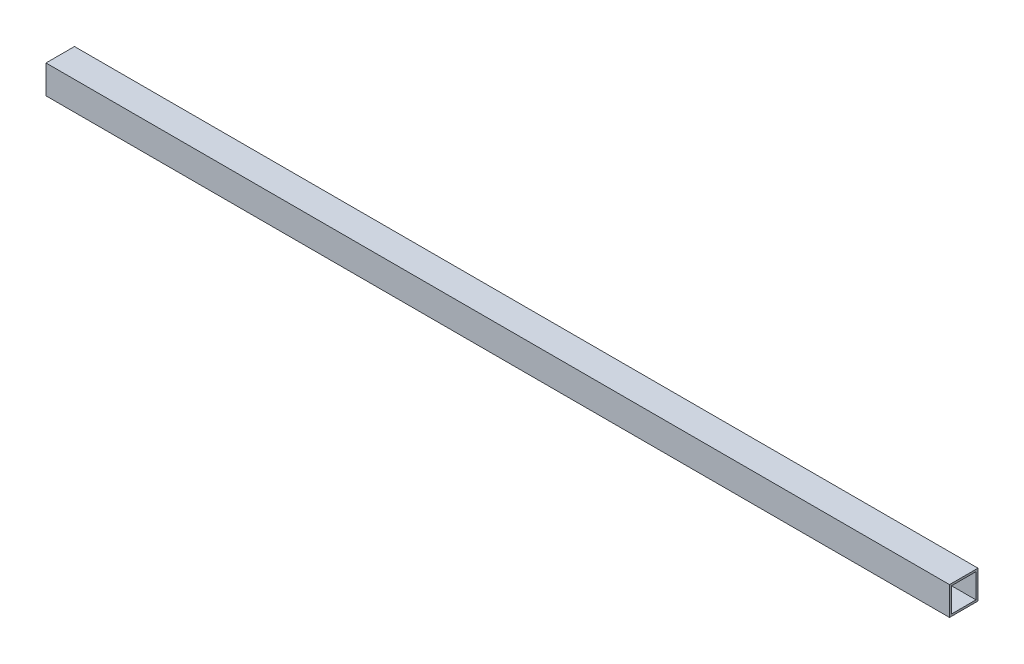
ISO-10303-21;
HEADER;
FILE_DESCRIPTION(('STEP AP214'),'2;1');
FILE_NAME('part.step','',(''),(''),'','','');
FILE_SCHEMA(('AUTOMOTIVE_DESIGN { 1 0 10303 214 1 1 1 1 }'));
ENDSEC;
DATA;
#1=APPLICATION_CONTEXT('core data for automotive mechanical design processes');
#2=APPLICATION_PROTOCOL_DEFINITION('international standard','automotive_design',2000,#1);
#3=PRODUCT_CONTEXT('',#1,'mechanical');
#4=PRODUCT('Part','Part','',(#3));
#5=PRODUCT_RELATED_PRODUCT_CATEGORY('part','',(#4));
#6=PRODUCT_DEFINITION_FORMATION('','',#4);
#7=PRODUCT_DEFINITION_CONTEXT('part definition',#1,'design');
#8=PRODUCT_DEFINITION('design','',#6,#7);
#9=PRODUCT_DEFINITION_SHAPE('','',#8);
#10=(LENGTH_UNIT() NAMED_UNIT(*) SI_UNIT(.MILLI.,.METRE.));
#11=(NAMED_UNIT(*) PLANE_ANGLE_UNIT() SI_UNIT($,.RADIAN.));
#12=(NAMED_UNIT(*) SI_UNIT($,.STERADIAN.) SOLID_ANGLE_UNIT());
#13=UNCERTAINTY_MEASURE_WITH_UNIT(LENGTH_MEASURE(1.E-05),#10,'distance_accuracy_value','');
#14=(GEOMETRIC_REPRESENTATION_CONTEXT(3) GLOBAL_UNCERTAINTY_ASSIGNED_CONTEXT((#13)) GLOBAL_UNIT_ASSIGNED_CONTEXT((#10,
#11,#12)) REPRESENTATION_CONTEXT('',''));
#15=CARTESIAN_POINT('',(0.,0.,0.));
#16=DIRECTION('',(0.,0.,1.));
#17=DIRECTION('',(1.,0.,0.));
#18=AXIS2_PLACEMENT_3D('',#15,#16,#17);
#19=CARTESIAN_POINT('',(0.,-41.275,44.45));
#20=DIRECTION('',(0.,-1.,0.));
#21=DIRECTION('',(0.,0.,-1.));
#22=AXIS2_PLACEMENT_3D('',#19,#20,#21);
#23=PLANE('',#22);
#24=DIRECTION('',(0.,0.,-1.));
#25=VECTOR('',#24,1.);
#26=CARTESIAN_POINT('',(-704.85,-41.275,44.45));
#27=LINE('',#26,#25);
#28=CARTESIAN_POINT('',(-704.85,-41.275,3.175));
#29=VERTEX_POINT('',#28);
#30=CARTESIAN_POINT('',(-704.85,-41.275,41.275));
#31=VERTEX_POINT('',#30);
#32=EDGE_CURVE('E114',#29,#31,#27,.F.);
#33=ORIENTED_EDGE('',*,*,#32,.T.);
#34=DIRECTION('',(1.,0.,0.));
#35=VECTOR('',#34,1.);
#36=CARTESIAN_POINT('',(0.,-41.275,41.275));
#37=LINE('',#36,#35);
#38=CARTESIAN_POINT('',(704.85,-41.275,41.275));
#39=VERTEX_POINT('',#38);
#40=EDGE_CURVE('E17',#31,#39,#37,.T.);
#41=ORIENTED_EDGE('',*,*,#40,.T.);
#42=DIRECTION('',(0.,0.,-1.));
#43=VECTOR('',#42,1.);
#44=CARTESIAN_POINT('',(704.85,-41.275,44.45));
#45=LINE('',#44,#43);
#46=CARTESIAN_POINT('',(704.85,-41.275,3.175));
#47=VERTEX_POINT('',#46);
#48=EDGE_CURVE('E105',#47,#39,#45,.F.);
#49=ORIENTED_EDGE('',*,*,#48,.F.);
#50=DIRECTION('',(1.,0.,0.));
#51=VECTOR('',#50,1.);
#52=CARTESIAN_POINT('',(0.,-41.275,3.175));
#53=LINE('',#52,#51);
#54=EDGE_CURVE('E101',#29,#47,#53,.T.);
#55=ORIENTED_EDGE('',*,*,#54,.F.);
#56=EDGE_LOOP('',(#33,#41,#49,#55));
#57=FACE_BOUND('',#56,.T.);
#58=ADVANCED_FACE('F14',(#57),#23,.F.);
#59=CARTESIAN_POINT('',(0.,-22.225,41.275));
#60=DIRECTION('',(0.,0.,1.));
#61=DIRECTION('',(1.,0.,0.));
#62=AXIS2_PLACEMENT_3D('',#59,#60,#61);
#63=PLANE('',#62);
#64=ORIENTED_EDGE('',*,*,#40,.F.);
#65=DIRECTION('',(0.,1.,0.));
#66=VECTOR('',#65,1.);
#67=CARTESIAN_POINT('',(-704.85,-22.225,41.275));
#68=LINE('',#67,#66);
#69=CARTESIAN_POINT('',(-704.85,-3.175,41.275));
#70=VERTEX_POINT('',#69);
#71=EDGE_CURVE('E129',#31,#70,#68,.T.);
#72=ORIENTED_EDGE('',*,*,#71,.T.);
#73=DIRECTION('',(1.,0.,0.));
#74=VECTOR('',#73,1.);
#75=CARTESIAN_POINT('',(0.,-3.175,41.275));
#76=LINE('',#75,#74);
#77=CARTESIAN_POINT('',(704.85,-3.175,41.275));
#78=VERTEX_POINT('',#77);
#79=EDGE_CURVE('E76',#78,#70,#76,.F.);
#80=ORIENTED_EDGE('',*,*,#79,.F.);
#81=DIRECTION('',(0.,1.,0.));
#82=VECTOR('',#81,1.);
#83=CARTESIAN_POINT('',(704.85,-22.225,41.275));
#84=LINE('',#83,#82);
#85=EDGE_CURVE('E89',#39,#78,#84,.T.);
#86=ORIENTED_EDGE('',*,*,#85,.F.);
#87=EDGE_LOOP('',(#64,#72,#80,#86));
#88=FACE_BOUND('',#87,.T.);
#89=ADVANCED_FACE('F116',(#88),#63,.F.);
#90=CARTESIAN_POINT('',(0.,-3.175,44.45));
#91=DIRECTION('',(0.,-1.,0.));
#92=DIRECTION('',(0.,0.,-1.));
#93=AXIS2_PLACEMENT_3D('',#90,#91,#92);
#94=PLANE('',#93);
#95=ORIENTED_EDGE('',*,*,#79,.T.);
#96=DIRECTION('',(0.,0.,-1.));
#97=VECTOR('',#96,1.);
#98=CARTESIAN_POINT('',(-704.85,-3.175,44.45));
#99=LINE('',#98,#97);
#100=CARTESIAN_POINT('',(-704.85,-3.175,3.175));
#101=VERTEX_POINT('',#100);
#102=EDGE_CURVE('E97',#70,#101,#99,.T.);
#103=ORIENTED_EDGE('',*,*,#102,.T.);
#104=DIRECTION('',(1.,0.,0.));
#105=VECTOR('',#104,1.);
#106=CARTESIAN_POINT('',(0.,-3.175,3.175));
#107=LINE('',#106,#105);
#108=CARTESIAN_POINT('',(704.85,-3.175,3.175));
#109=VERTEX_POINT('',#108);
#110=EDGE_CURVE('E94',#109,#101,#107,.F.);
#111=ORIENTED_EDGE('',*,*,#110,.F.);
#112=DIRECTION('',(0.,0.,-1.));
#113=VECTOR('',#112,1.);
#114=CARTESIAN_POINT('',(704.85,-3.175,44.45));
#115=LINE('',#114,#113);
#116=EDGE_CURVE('E82',#78,#109,#115,.T.);
#117=ORIENTED_EDGE('',*,*,#116,.F.);
#118=EDGE_LOOP('',(#95,#103,#111,#117));
#119=FACE_BOUND('',#118,.T.);
#120=ADVANCED_FACE('F95',(#119),#94,.T.);
#121=CARTESIAN_POINT('',(0.,-22.225,3.175));
#122=DIRECTION('',(0.,0.,1.));
#123=DIRECTION('',(1.,0.,0.));
#124=AXIS2_PLACEMENT_3D('',#121,#122,#123);
#125=PLANE('',#124);
#126=DIRECTION('',(0.,1.,0.));
#127=VECTOR('',#126,1.);
#128=CARTESIAN_POINT('',(-704.85,-22.225,3.175));
#129=LINE('',#128,#127);
#130=EDGE_CURVE('E132',#101,#29,#129,.F.);
#131=ORIENTED_EDGE('',*,*,#130,.T.);
#132=ORIENTED_EDGE('',*,*,#54,.T.);
#133=DIRECTION('',(0.,1.,0.));
#134=VECTOR('',#133,1.);
#135=CARTESIAN_POINT('',(704.85,-22.225,3.175));
#136=LINE('',#135,#134);
#137=EDGE_CURVE('E87',#109,#47,#136,.F.);
#138=ORIENTED_EDGE('',*,*,#137,.F.);
#139=ORIENTED_EDGE('',*,*,#110,.T.);
#140=EDGE_LOOP('',(#131,#132,#138,#139));
#141=FACE_BOUND('',#140,.T.);
#142=ADVANCED_FACE('F103',(#141),#125,.T.);
#143=CARTESIAN_POINT('',(0.,-44.45,44.45));
#144=DIRECTION('',(0.,-1.,0.));
#145=DIRECTION('',(0.,0.,-1.));
#146=AXIS2_PLACEMENT_3D('',#143,#144,#145);
#147=PLANE('',#146);
#148=DIRECTION('',(1.,0.,0.));
#149=VECTOR('',#148,1.);
#150=CARTESIAN_POINT('',(0.,-44.45,44.45));
#151=LINE('',#150,#149);
#152=CARTESIAN_POINT('',(-704.85,-44.45,44.45));
#153=VERTEX_POINT('',#152);
#154=CARTESIAN_POINT('',(704.85,-44.45,44.45));
#155=VERTEX_POINT('',#154);
#156=EDGE_CURVE('E118',#153,#155,#151,.T.);
#157=ORIENTED_EDGE('',*,*,#156,.F.);
#158=DIRECTION('',(0.,0.,-1.));
#159=VECTOR('',#158,1.);
#160=CARTESIAN_POINT('',(-704.85,-44.45,44.45));
#161=LINE('',#160,#159);
#162=CARTESIAN_POINT('',(-704.85,-44.45,0.));
#163=VERTEX_POINT('',#162);
#164=EDGE_CURVE('E126',#153,#163,#161,.T.);
#165=ORIENTED_EDGE('',*,*,#164,.T.);
#166=DIRECTION('',(1.,0.,0.));
#167=VECTOR('',#166,1.);
#168=CARTESIAN_POINT('',(0.,-44.45,0.));
#169=LINE('',#168,#167);
#170=CARTESIAN_POINT('',(704.85,-44.45,0.));
#171=VERTEX_POINT('',#170);
#172=EDGE_CURVE('E135',#163,#171,#169,.T.);
#173=ORIENTED_EDGE('',*,*,#172,.T.);
#174=DIRECTION('',(0.,0.,-1.));
#175=VECTOR('',#174,1.);
#176=CARTESIAN_POINT('',(704.85,-44.45,44.45));
#177=LINE('',#176,#175);
#178=EDGE_CURVE('E91',#155,#171,#177,.T.);
#179=ORIENTED_EDGE('',*,*,#178,.F.);
#180=EDGE_LOOP('',(#157,#165,#173,#179));
#181=FACE_BOUND('',#180,.T.);
#182=ADVANCED_FACE('F175',(#181),#147,.T.);
#183=CARTESIAN_POINT('',(704.85,-22.225,44.45));
#184=DIRECTION('',(1.,0.,0.));
#185=DIRECTION('',(0.,0.,-1.));
#186=AXIS2_PLACEMENT_3D('',#183,#184,#185);
#187=PLANE('',#186);
#188=ORIENTED_EDGE('',*,*,#48,.T.);
#189=ORIENTED_EDGE('',*,*,#85,.T.);
#190=ORIENTED_EDGE('',*,*,#116,.T.);
#191=ORIENTED_EDGE('',*,*,#137,.T.);
#192=EDGE_LOOP('',(#188,#189,#190,#191));
#193=FACE_BOUND('',#192,.T.);
#194=DIRECTION('',(0.,1.,0.));
#195=VECTOR('',#194,1.);
#196=CARTESIAN_POINT('',(704.85,-22.225,44.45));
#197=LINE('',#196,#195);
#198=CARTESIAN_POINT('',(704.85,0.,44.45));
#199=VERTEX_POINT('',#198);
#200=EDGE_CURVE('E117',#155,#199,#197,.T.);
#201=ORIENTED_EDGE('',*,*,#200,.F.);
#202=ORIENTED_EDGE('',*,*,#178,.T.);
#203=DIRECTION('',(0.,1.,0.));
#204=VECTOR('',#203,1.);
#205=CARTESIAN_POINT('',(704.85,-22.225,0.));
#206=LINE('',#205,#204);
#207=CARTESIAN_POINT('',(704.85,0.,0.));
#208=VERTEX_POINT('',#207);
#209=EDGE_CURVE('E138',#171,#208,#206,.T.);
#210=ORIENTED_EDGE('',*,*,#209,.T.);
#211=DIRECTION('',(0.,0.,-1.));
#212=VECTOR('',#211,1.);
#213=CARTESIAN_POINT('',(704.85,0.,44.45));
#214=LINE('',#213,#212);
#215=EDGE_CURVE('E141',#208,#199,#214,.F.);
#216=ORIENTED_EDGE('',*,*,#215,.T.);
#217=EDGE_LOOP('',(#201,#202,#210,#216));
#218=FACE_BOUND('',#217,.T.);
#219=ADVANCED_FACE('F84',(#193,#218),#187,.T.);
#220=CARTESIAN_POINT('',(0.,-22.225,44.45));
#221=DIRECTION('',(0.,0.,1.));
#222=DIRECTION('',(1.,0.,0.));
#223=AXIS2_PLACEMENT_3D('',#220,#221,#222);
#224=PLANE('',#223);
#225=DIRECTION('',(0.,1.,0.));
#226=VECTOR('',#225,1.);
#227=CARTESIAN_POINT('',(-704.85,-22.225,44.45));
#228=LINE('',#227,#226);
#229=CARTESIAN_POINT('',(-704.85,0.,44.45));
#230=VERTEX_POINT('',#229);
#231=EDGE_CURVE('E123',#230,#153,#228,.F.);
#232=ORIENTED_EDGE('',*,*,#231,.T.);
#233=ORIENTED_EDGE('',*,*,#156,.T.);
#234=ORIENTED_EDGE('',*,*,#200,.T.);
#235=DIRECTION('',(1.,0.,0.));
#236=VECTOR('',#235,1.);
#237=CARTESIAN_POINT('',(0.,0.,44.45));
#238=LINE('',#237,#236);
#239=EDGE_CURVE('E144',#199,#230,#238,.F.);
#240=ORIENTED_EDGE('',*,*,#239,.T.);
#241=EDGE_LOOP('',(#232,#233,#234,#240));
#242=FACE_BOUND('',#241,.T.);
#243=ADVANCED_FACE('F156',(#242),#224,.T.);
#244=CARTESIAN_POINT('',(-704.85,-22.225,44.45));
#245=DIRECTION('',(1.,0.,0.));
#246=DIRECTION('',(0.,0.,-1.));
#247=AXIS2_PLACEMENT_3D('',#244,#245,#246);
#248=PLANE('',#247);
#249=ORIENTED_EDGE('',*,*,#102,.F.);
#250=ORIENTED_EDGE('',*,*,#71,.F.);
#251=ORIENTED_EDGE('',*,*,#32,.F.);
#252=ORIENTED_EDGE('',*,*,#130,.F.);
#253=EDGE_LOOP('',(#249,#250,#251,#252));
#254=FACE_BOUND('',#253,.T.);
#255=ORIENTED_EDGE('',*,*,#164,.F.);
#256=ORIENTED_EDGE('',*,*,#231,.F.);
#257=DIRECTION('',(0.,0.,-1.));
#258=VECTOR('',#257,1.);
#259=CARTESIAN_POINT('',(-704.85,0.,44.45));
#260=LINE('',#259,#258);
#261=CARTESIAN_POINT('',(-704.85,0.,0.));
#262=VERTEX_POINT('',#261);
#263=EDGE_CURVE('E23',#230,#262,#260,.T.);
#264=ORIENTED_EDGE('',*,*,#263,.T.);
#265=DIRECTION('',(0.,1.,0.));
#266=VECTOR('',#265,1.);
#267=CARTESIAN_POINT('',(-704.85,-22.225,0.));
#268=LINE('',#267,#266);
#269=EDGE_CURVE('E31',#262,#163,#268,.F.);
#270=ORIENTED_EDGE('',*,*,#269,.T.);
#271=EDGE_LOOP('',(#255,#256,#264,#270));
#272=FACE_BOUND('',#271,.T.);
#273=ADVANCED_FACE('F151',(#254,#272),#248,.F.);
#274=CARTESIAN_POINT('',(0.,-22.225,0.));
#275=DIRECTION('',(0.,0.,1.));
#276=DIRECTION('',(1.,0.,0.));
#277=AXIS2_PLACEMENT_3D('',#274,#275,#276);
#278=PLANE('',#277);
#279=ORIENTED_EDGE('',*,*,#172,.F.);
#280=ORIENTED_EDGE('',*,*,#269,.F.);
#281=DIRECTION('',(1.,0.,0.));
#282=VECTOR('',#281,1.);
#283=CARTESIAN_POINT('',(0.,0.,0.));
#284=LINE('',#283,#282);
#285=EDGE_CURVE('E9',#262,#208,#284,.T.);
#286=ORIENTED_EDGE('',*,*,#285,.T.);
#287=ORIENTED_EDGE('',*,*,#209,.F.);
#288=EDGE_LOOP('',(#279,#280,#286,#287));
#289=FACE_BOUND('',#288,.T.);
#290=ADVANCED_FACE('F159',(#289),#278,.F.);
#291=CARTESIAN_POINT('',(0.,0.,44.45));
#292=DIRECTION('',(0.,-1.,0.));
#293=DIRECTION('',(0.,0.,-1.));
#294=AXIS2_PLACEMENT_3D('',#291,#292,#293);
#295=PLANE('',#294);
#296=ORIENTED_EDGE('',*,*,#263,.F.);
#297=ORIENTED_EDGE('',*,*,#239,.F.);
#298=ORIENTED_EDGE('',*,*,#215,.F.);
#299=ORIENTED_EDGE('',*,*,#285,.F.);
#300=EDGE_LOOP('',(#296,#297,#298,#299));
#301=FACE_BOUND('',#300,.T.);
#302=ADVANCED_FACE('F154',(#301),#295,.F.);
#303=CLOSED_SHELL('',(#58,#89,#120,#142,#182,#219,#243,#273,#290,#302));
#304=MANIFOLD_SOLID_BREP('B1',#303);
#305=ADVANCED_BREP_SHAPE_REPRESENTATION('',(#18,#304),#14);
#306=SHAPE_DEFINITION_REPRESENTATION(#9,#305);
ENDSEC;
END-ISO-10303-21;
